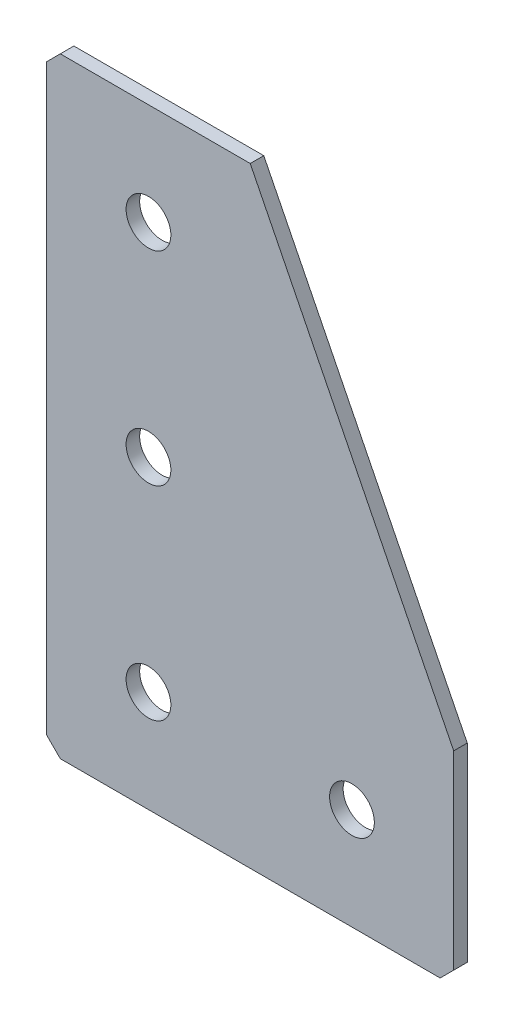
ISO-10303-21;
HEADER;
FILE_DESCRIPTION(('STEP AP214'),'2;1');
FILE_NAME('part.step','',(''),(''),'','','');
FILE_SCHEMA(('AUTOMOTIVE_DESIGN { 1 0 10303 214 1 1 1 1 }'));
ENDSEC;
DATA;
#1=APPLICATION_CONTEXT('core data for automotive mechanical design processes');
#2=APPLICATION_PROTOCOL_DEFINITION('international standard','automotive_design',2000,#1);
#3=PRODUCT_CONTEXT('',#1,'mechanical');
#4=PRODUCT('Part','Part','',(#3));
#5=PRODUCT_RELATED_PRODUCT_CATEGORY('part','',(#4));
#6=PRODUCT_DEFINITION_FORMATION('','',#4);
#7=PRODUCT_DEFINITION_CONTEXT('part definition',#1,'design');
#8=PRODUCT_DEFINITION('design','',#6,#7);
#9=PRODUCT_DEFINITION_SHAPE('','',#8);
#10=(LENGTH_UNIT() NAMED_UNIT(*) SI_UNIT(.MILLI.,.METRE.));
#11=(NAMED_UNIT(*) PLANE_ANGLE_UNIT() SI_UNIT($,.RADIAN.));
#12=(NAMED_UNIT(*) SI_UNIT($,.STERADIAN.) SOLID_ANGLE_UNIT());
#13=UNCERTAINTY_MEASURE_WITH_UNIT(LENGTH_MEASURE(1.E-05),#10,'distance_accuracy_value','');
#14=(GEOMETRIC_REPRESENTATION_CONTEXT(3) GLOBAL_UNCERTAINTY_ASSIGNED_CONTEXT((#13)) GLOBAL_UNIT_ASSIGNED_CONTEXT((#10,
#11,#12)) REPRESENTATION_CONTEXT('',''));
#15=CARTESIAN_POINT('',(0.,0.,0.));
#16=DIRECTION('',(0.,0.,1.));
#17=DIRECTION('',(1.,0.,0.));
#18=AXIS2_PLACEMENT_3D('',#15,#16,#17);
#19=CARTESIAN_POINT('',(30.,0.,-2.));
#20=DIRECTION('',(0.,-1.,0.));
#21=DIRECTION('',(1.,0.,0.));
#22=AXIS2_PLACEMENT_3D('',#19,#20,#21);
#23=PLANE('',#22);
#24=DIRECTION('',(1.,0.,0.));
#25=VECTOR('',#24,1.);
#26=CARTESIAN_POINT('',(30.,0.,-2.));
#27=LINE('',#26,#25);
#28=CARTESIAN_POINT('',(2.,0.,-2.));
#29=VERTEX_POINT('',#28);
#30=CARTESIAN_POINT('',(30.,0.,-2.));
#31=VERTEX_POINT('',#30);
#32=EDGE_CURVE('E106',#29,#31,#27,.T.);
#33=ORIENTED_EDGE('',*,*,#32,.F.);
#34=DIRECTION('',(0.,0.,1.));
#35=VECTOR('',#34,1.);
#36=CARTESIAN_POINT('',(2.,0.,-2.));
#37=LINE('',#36,#35);
#38=CARTESIAN_POINT('',(2.,0.,0.));
#39=VERTEX_POINT('',#38);
#40=EDGE_CURVE('E135',#29,#39,#37,.T.);
#41=ORIENTED_EDGE('',*,*,#40,.T.);
#42=DIRECTION('',(1.,0.,0.));
#43=VECTOR('',#42,1.);
#44=CARTESIAN_POINT('',(30.,0.,0.));
#45=LINE('',#44,#43);
#46=CARTESIAN_POINT('',(30.,0.,0.));
#47=VERTEX_POINT('',#46);
#48=EDGE_CURVE('E132',#39,#47,#45,.T.);
#49=ORIENTED_EDGE('',*,*,#48,.T.);
#50=DIRECTION('',(0.,0.,1.));
#51=VECTOR('',#50,1.);
#52=CARTESIAN_POINT('',(30.,0.,-2.));
#53=LINE('',#52,#51);
#54=EDGE_CURVE('E124',#31,#47,#53,.T.);
#55=ORIENTED_EDGE('',*,*,#54,.F.);
#56=EDGE_LOOP('',(#33,#41,#49,#55));
#57=FACE_BOUND('',#56,.T.);
#58=ADVANCED_FACE('F41',(#57),#23,.F.);
#59=CARTESIAN_POINT('',(60.,-60.,-2.));
#60=DIRECTION('',(-0.894427190999916,-0.447213595499958,0.));
#61=DIRECTION('',(0.447213595499958,-0.894427190999916,0.));
#62=AXIS2_PLACEMENT_3D('',#59,#60,#61);
#63=PLANE('',#62);
#64=DIRECTION('',(0.447213595499958,-0.894427190999916,0.));
#65=VECTOR('',#64,1.);
#66=CARTESIAN_POINT('',(60.,-60.,0.));
#67=LINE('',#66,#65);
#68=CARTESIAN_POINT('',(60.,-60.,0.));
#69=VERTEX_POINT('',#68);
#70=EDGE_CURVE('E190',#47,#69,#67,.T.);
#71=ORIENTED_EDGE('',*,*,#70,.T.);
#72=DIRECTION('',(0.,0.,1.));
#73=VECTOR('',#72,1.);
#74=CARTESIAN_POINT('',(60.,-60.,-2.));
#75=LINE('',#74,#73);
#76=CARTESIAN_POINT('',(60.,-60.,-2.));
#77=VERTEX_POINT('',#76);
#78=EDGE_CURVE('E126',#77,#69,#75,.T.);
#79=ORIENTED_EDGE('',*,*,#78,.F.);
#80=DIRECTION('',(0.447213595499958,-0.894427190999916,0.));
#81=VECTOR('',#80,1.);
#82=CARTESIAN_POINT('',(60.,-60.,-2.));
#83=LINE('',#82,#81);
#84=EDGE_CURVE('E110',#31,#77,#83,.T.);
#85=ORIENTED_EDGE('',*,*,#84,.F.);
#86=ORIENTED_EDGE('',*,*,#54,.T.);
#87=EDGE_LOOP('',(#71,#79,#85,#86));
#88=FACE_BOUND('',#87,.T.);
#89=ADVANCED_FACE('F123',(#88),#63,.F.);
#90=CARTESIAN_POINT('',(60.,-90.,-2.));
#91=DIRECTION('',(-1.,0.,0.));
#92=DIRECTION('',(0.,-1.,0.));
#93=AXIS2_PLACEMENT_3D('',#90,#91,#92);
#94=PLANE('',#93);
#95=DIRECTION('',(0.,-1.,0.));
#96=VECTOR('',#95,1.);
#97=CARTESIAN_POINT('',(60.,-90.,0.));
#98=LINE('',#97,#96);
#99=CARTESIAN_POINT('',(60.,-88.,0.));
#100=VERTEX_POINT('',#99);
#101=EDGE_CURVE('E184',#69,#100,#98,.T.);
#102=ORIENTED_EDGE('',*,*,#101,.T.);
#103=DIRECTION('',(0.,0.,-1.));
#104=VECTOR('',#103,1.);
#105=CARTESIAN_POINT('',(60.,-88.,-2.));
#106=LINE('',#105,#104);
#107=CARTESIAN_POINT('',(60.,-88.,-2.));
#108=VERTEX_POINT('',#107);
#109=EDGE_CURVE('E11',#100,#108,#106,.T.);
#110=ORIENTED_EDGE('',*,*,#109,.T.);
#111=DIRECTION('',(0.,-1.,0.));
#112=VECTOR('',#111,1.);
#113=CARTESIAN_POINT('',(60.,-90.,-2.));
#114=LINE('',#113,#112);
#115=EDGE_CURVE('E129',#77,#108,#114,.T.);
#116=ORIENTED_EDGE('',*,*,#115,.F.);
#117=ORIENTED_EDGE('',*,*,#78,.T.);
#118=EDGE_LOOP('',(#102,#110,#116,#117));
#119=FACE_BOUND('',#118,.T.);
#120=ADVANCED_FACE('F269',(#119),#94,.F.);
#121=CARTESIAN_POINT('',(0.,-90.,-2.));
#122=DIRECTION('',(0.,1.,0.));
#123=DIRECTION('',(0.,0.,1.));
#124=AXIS2_PLACEMENT_3D('',#121,#122,#123);
#125=PLANE('',#124);
#126=DIRECTION('',(-1.,0.,0.));
#127=VECTOR('',#126,1.);
#128=CARTESIAN_POINT('',(0.,-90.,-2.));
#129=LINE('',#128,#127);
#130=CARTESIAN_POINT('',(58.,-90.,-2.));
#131=VERTEX_POINT('',#130);
#132=CARTESIAN_POINT('',(2.00000000000002,-90.,-2.));
#133=VERTEX_POINT('',#132);
#134=EDGE_CURVE('E176',#131,#133,#129,.T.);
#135=ORIENTED_EDGE('',*,*,#134,.F.);
#136=DIRECTION('',(0.,0.,1.));
#137=VECTOR('',#136,1.);
#138=CARTESIAN_POINT('',(58.,-90.,-2.));
#139=LINE('',#138,#137);
#140=CARTESIAN_POINT('',(58.,-90.,0.));
#141=VERTEX_POINT('',#140);
#142=EDGE_CURVE('E50',#131,#141,#139,.T.);
#143=ORIENTED_EDGE('',*,*,#142,.T.);
#144=DIRECTION('',(-1.,0.,0.));
#145=VECTOR('',#144,1.);
#146=CARTESIAN_POINT('',(0.,-90.,0.));
#147=LINE('',#146,#145);
#148=CARTESIAN_POINT('',(2.00000000000002,-90.,0.));
#149=VERTEX_POINT('',#148);
#150=EDGE_CURVE('E175',#141,#149,#147,.T.);
#151=ORIENTED_EDGE('',*,*,#150,.T.);
#152=DIRECTION('',(0.,0.,-1.));
#153=VECTOR('',#152,1.);
#154=CARTESIAN_POINT('',(2.00000000000002,-90.,-2.));
#155=LINE('',#154,#153);
#156=EDGE_CURVE('E57',#149,#133,#155,.T.);
#157=ORIENTED_EDGE('',*,*,#156,.T.);
#158=EDGE_LOOP('',(#135,#143,#151,#157));
#159=FACE_BOUND('',#158,.T.);
#160=ADVANCED_FACE('F174',(#159),#125,.F.);
#161=CARTESIAN_POINT('',(0.,0.,-2.));
#162=DIRECTION('',(1.,0.,0.));
#163=DIRECTION('',(0.,0.,-1.));
#164=AXIS2_PLACEMENT_3D('',#161,#162,#163);
#165=PLANE('',#164);
#166=DIRECTION('',(0.,1.,0.));
#167=VECTOR('',#166,1.);
#168=CARTESIAN_POINT('',(0.,0.,0.));
#169=LINE('',#168,#167);
#170=CARTESIAN_POINT('',(0.,-88.,0.));
#171=VERTEX_POINT('',#170);
#172=CARTESIAN_POINT('',(0.,-2.00000000000001,0.));
#173=VERTEX_POINT('',#172);
#174=EDGE_CURVE('E119',#171,#173,#169,.T.);
#175=ORIENTED_EDGE('',*,*,#174,.T.);
#176=DIRECTION('',(0.,0.,-1.));
#177=VECTOR('',#176,1.);
#178=CARTESIAN_POINT('',(0.,-2.00000000000002,-2.));
#179=LINE('',#178,#177);
#180=CARTESIAN_POINT('',(0.,-2.00000000000001,-2.));
#181=VERTEX_POINT('',#180);
#182=EDGE_CURVE('E158',#173,#181,#179,.T.);
#183=ORIENTED_EDGE('',*,*,#182,.T.);
#184=DIRECTION('',(0.,1.,0.));
#185=VECTOR('',#184,1.);
#186=CARTESIAN_POINT('',(0.,0.,-2.));
#187=LINE('',#186,#185);
#188=CARTESIAN_POINT('',(0.,-88.,-2.));
#189=VERTEX_POINT('',#188);
#190=EDGE_CURVE('E142',#189,#181,#187,.T.);
#191=ORIENTED_EDGE('',*,*,#190,.F.);
#192=DIRECTION('',(0.,0.,1.));
#193=VECTOR('',#192,1.);
#194=CARTESIAN_POINT('',(0.,-88.,-2.));
#195=LINE('',#194,#193);
#196=EDGE_CURVE('E154',#189,#171,#195,.T.);
#197=ORIENTED_EDGE('',*,*,#196,.T.);
#198=EDGE_LOOP('',(#175,#183,#191,#197));
#199=FACE_BOUND('',#198,.T.);
#200=ADVANCED_FACE('F241',(#199),#165,.F.);
#201=CARTESIAN_POINT('',(0.,0.,-2.));
#202=DIRECTION('',(0.,0.,1.));
#203=DIRECTION('',(1.,0.,0.));
#204=AXIS2_PLACEMENT_3D('',#201,#202,#203);
#205=PLANE('',#204);
#206=CARTESIAN_POINT('',(45.,-75.,-2.));
#207=DIRECTION('',(0.,0.,-1.));
#208=DIRECTION('',(0.,1.,0.));
#209=AXIS2_PLACEMENT_3D('',#206,#207,#208);
#210=CIRCLE('',#209,3.3);
#211=CARTESIAN_POINT('',(45.,-71.7,-2.));
#212=VERTEX_POINT('',#211);
#213=EDGE_CURVE('E231',#212,#212,#210,.T.);
#214=ORIENTED_EDGE('',*,*,#213,.F.);
#215=EDGE_LOOP('',(#214));
#216=FACE_BOUND('',#215,.T.);
#217=CARTESIAN_POINT('',(15.,-75.,-2.));
#218=DIRECTION('',(0.,0.,-1.));
#219=DIRECTION('',(0.,1.,0.));
#220=AXIS2_PLACEMENT_3D('',#217,#218,#219);
#221=CIRCLE('',#220,3.3);
#222=CARTESIAN_POINT('',(15.,-71.7,-2.));
#223=VERTEX_POINT('',#222);
#224=EDGE_CURVE('E223',#223,#223,#221,.T.);
#225=ORIENTED_EDGE('',*,*,#224,.F.);
#226=EDGE_LOOP('',(#225));
#227=FACE_BOUND('',#226,.T.);
#228=CARTESIAN_POINT('',(15.,-45.,-2.));
#229=DIRECTION('',(0.,0.,-1.));
#230=DIRECTION('',(0.,1.,0.));
#231=AXIS2_PLACEMENT_3D('',#228,#229,#230);
#232=CIRCLE('',#231,3.3);
#233=CARTESIAN_POINT('',(15.,-41.7,-2.));
#234=VERTEX_POINT('',#233);
#235=EDGE_CURVE('E215',#234,#234,#232,.T.);
#236=ORIENTED_EDGE('',*,*,#235,.F.);
#237=EDGE_LOOP('',(#236));
#238=FACE_BOUND('',#237,.T.);
#239=CARTESIAN_POINT('',(15.,-15.,-2.));
#240=DIRECTION('',(0.,0.,-1.));
#241=DIRECTION('',(0.,1.,0.));
#242=AXIS2_PLACEMENT_3D('',#239,#240,#241);
#243=CIRCLE('',#242,3.3);
#244=CARTESIAN_POINT('',(15.,-11.7,-2.));
#245=VERTEX_POINT('',#244);
#246=EDGE_CURVE('E207',#245,#245,#243,.T.);
#247=ORIENTED_EDGE('',*,*,#246,.F.);
#248=EDGE_LOOP('',(#247));
#249=FACE_BOUND('',#248,.T.);
#250=ORIENTED_EDGE('',*,*,#190,.T.);
#251=DIRECTION('',(-0.707106781186545,-0.70710678118655,0.));
#252=VECTOR('',#251,1.);
#253=CARTESIAN_POINT('',(2.,0.,-2.));
#254=LINE('',#253,#252);
#255=EDGE_CURVE('E113',#181,#29,#254,.F.);
#256=ORIENTED_EDGE('',*,*,#255,.T.);
#257=ORIENTED_EDGE('',*,*,#32,.T.);
#258=ORIENTED_EDGE('',*,*,#84,.T.);
#259=ORIENTED_EDGE('',*,*,#115,.T.);
#260=DIRECTION('',(0.707106781186545,0.70710678118655,0.));
#261=VECTOR('',#260,1.);
#262=CARTESIAN_POINT('',(58.,-90.,-2.));
#263=LINE('',#262,#261);
#264=EDGE_CURVE('E64',#108,#131,#263,.F.);
#265=ORIENTED_EDGE('',*,*,#264,.T.);
#266=ORIENTED_EDGE('',*,*,#134,.T.);
#267=DIRECTION('',(0.707106781186552,-0.707106781186543,0.));
#268=VECTOR('',#267,1.);
#269=CARTESIAN_POINT('',(0.,-88.,-2.));
#270=LINE('',#269,#268);
#271=EDGE_CURVE('E161',#133,#189,#270,.F.);
#272=ORIENTED_EDGE('',*,*,#271,.T.);
#273=EDGE_LOOP('',(#250,#256,#257,#258,#259,#265,#266,#272));
#274=FACE_BOUND('',#273,.T.);
#275=ADVANCED_FACE('F109',(#216,#227,#238,#249,#274),#205,.F.);
#276=CARTESIAN_POINT('',(0.,0.,0.));
#277=DIRECTION('',(0.,0.,1.));
#278=DIRECTION('',(1.,0.,0.));
#279=AXIS2_PLACEMENT_3D('',#276,#277,#278);
#280=PLANE('',#279);
#281=CARTESIAN_POINT('',(45.,-75.,0.));
#282=DIRECTION('',(0.,0.,-1.));
#283=DIRECTION('',(0.,1.,0.));
#284=AXIS2_PLACEMENT_3D('',#281,#282,#283);
#285=CIRCLE('',#284,3.3);
#286=CARTESIAN_POINT('',(45.,-71.7,0.));
#287=VERTEX_POINT('',#286);
#288=EDGE_CURVE('E227',#287,#287,#285,.T.);
#289=ORIENTED_EDGE('',*,*,#288,.T.);
#290=EDGE_LOOP('',(#289));
#291=FACE_BOUND('',#290,.T.);
#292=CARTESIAN_POINT('',(15.,-75.,0.));
#293=DIRECTION('',(0.,0.,-1.));
#294=DIRECTION('',(0.,1.,0.));
#295=AXIS2_PLACEMENT_3D('',#292,#293,#294);
#296=CIRCLE('',#295,3.3);
#297=CARTESIAN_POINT('',(15.,-71.7,0.));
#298=VERTEX_POINT('',#297);
#299=EDGE_CURVE('E219',#298,#298,#296,.T.);
#300=ORIENTED_EDGE('',*,*,#299,.T.);
#301=EDGE_LOOP('',(#300));
#302=FACE_BOUND('',#301,.T.);
#303=CARTESIAN_POINT('',(15.,-45.,0.));
#304=DIRECTION('',(0.,0.,-1.));
#305=DIRECTION('',(0.,1.,0.));
#306=AXIS2_PLACEMENT_3D('',#303,#304,#305);
#307=CIRCLE('',#306,3.3);
#308=CARTESIAN_POINT('',(15.,-41.7,0.));
#309=VERTEX_POINT('',#308);
#310=EDGE_CURVE('E211',#309,#309,#307,.T.);
#311=ORIENTED_EDGE('',*,*,#310,.T.);
#312=EDGE_LOOP('',(#311));
#313=FACE_BOUND('',#312,.T.);
#314=CARTESIAN_POINT('',(15.,-15.,0.));
#315=DIRECTION('',(0.,0.,-1.));
#316=DIRECTION('',(0.,1.,0.));
#317=AXIS2_PLACEMENT_3D('',#314,#315,#316);
#318=CIRCLE('',#317,3.3);
#319=CARTESIAN_POINT('',(15.,-11.7,0.));
#320=VERTEX_POINT('',#319);
#321=EDGE_CURVE('E197',#320,#320,#318,.T.);
#322=ORIENTED_EDGE('',*,*,#321,.T.);
#323=EDGE_LOOP('',(#322));
#324=FACE_BOUND('',#323,.T.);
#325=ORIENTED_EDGE('',*,*,#48,.F.);
#326=DIRECTION('',(0.707106781186545,0.70710678118655,0.));
#327=VECTOR('',#326,1.);
#328=CARTESIAN_POINT('',(1.00000000000001,-1.,0.));
#329=LINE('',#328,#327);
#330=EDGE_CURVE('E151',#39,#173,#329,.F.);
#331=ORIENTED_EDGE('',*,*,#330,.T.);
#332=ORIENTED_EDGE('',*,*,#174,.F.);
#333=DIRECTION('',(-0.707106781186552,0.707106781186543,0.));
#334=VECTOR('',#333,1.);
#335=CARTESIAN_POINT('',(-44.,-44.0000000000006,0.));
#336=LINE('',#335,#334);
#337=EDGE_CURVE('E140',#171,#149,#336,.F.);
#338=ORIENTED_EDGE('',*,*,#337,.T.);
#339=ORIENTED_EDGE('',*,*,#150,.F.);
#340=DIRECTION('',(-0.707106781186545,-0.70710678118655,0.));
#341=VECTOR('',#340,1.);
#342=CARTESIAN_POINT('',(74.0000000000002,-73.9999999999997,0.));
#343=LINE('',#342,#341);
#344=EDGE_CURVE('E148',#141,#100,#343,.F.);
#345=ORIENTED_EDGE('',*,*,#344,.T.);
#346=ORIENTED_EDGE('',*,*,#101,.F.);
#347=ORIENTED_EDGE('',*,*,#70,.F.);
#348=EDGE_LOOP('',(#325,#331,#332,#338,#339,#345,#346,#347));
#349=FACE_BOUND('',#348,.T.);
#350=ADVANCED_FACE('F179',(#291,#302,#313,#324,#349),#280,.T.);
#351=CARTESIAN_POINT('',(15.,-15.,-2.));
#352=DIRECTION('',(0.,0.,-1.));
#353=DIRECTION('',(0.,1.,0.));
#354=AXIS2_PLACEMENT_3D('',#351,#352,#353);
#355=CYLINDRICAL_SURFACE('',#354,3.3);
#356=ORIENTED_EDGE('',*,*,#321,.F.);
#357=EDGE_LOOP('',(#356));
#358=FACE_BOUND('',#357,.T.);
#359=ORIENTED_EDGE('',*,*,#246,.T.);
#360=EDGE_LOOP('',(#359));
#361=FACE_BOUND('',#360,.T.);
#362=ADVANCED_FACE('F249',(#358,#361),#355,.F.);
#363=CARTESIAN_POINT('',(15.,-45.,-2.));
#364=DIRECTION('',(0.,0.,-1.));
#365=DIRECTION('',(0.,1.,0.));
#366=AXIS2_PLACEMENT_3D('',#363,#364,#365);
#367=CYLINDRICAL_SURFACE('',#366,3.3);
#368=ORIENTED_EDGE('',*,*,#310,.F.);
#369=EDGE_LOOP('',(#368));
#370=FACE_BOUND('',#369,.T.);
#371=ORIENTED_EDGE('',*,*,#235,.T.);
#372=EDGE_LOOP('',(#371));
#373=FACE_BOUND('',#372,.T.);
#374=ADVANCED_FACE('F251',(#370,#373),#367,.F.);
#375=CARTESIAN_POINT('',(15.,-75.,-2.));
#376=DIRECTION('',(0.,0.,-1.));
#377=DIRECTION('',(0.,1.,0.));
#378=AXIS2_PLACEMENT_3D('',#375,#376,#377);
#379=CYLINDRICAL_SURFACE('',#378,3.3);
#380=ORIENTED_EDGE('',*,*,#299,.F.);
#381=EDGE_LOOP('',(#380));
#382=FACE_BOUND('',#381,.T.);
#383=ORIENTED_EDGE('',*,*,#224,.T.);
#384=EDGE_LOOP('',(#383));
#385=FACE_BOUND('',#384,.T.);
#386=ADVANCED_FACE('F258',(#382,#385),#379,.F.);
#387=CARTESIAN_POINT('',(45.,-75.,-2.));
#388=DIRECTION('',(0.,0.,-1.));
#389=DIRECTION('',(0.,1.,0.));
#390=AXIS2_PLACEMENT_3D('',#387,#388,#389);
#391=CYLINDRICAL_SURFACE('',#390,3.3);
#392=ORIENTED_EDGE('',*,*,#288,.F.);
#393=EDGE_LOOP('',(#392));
#394=FACE_BOUND('',#393,.T.);
#395=ORIENTED_EDGE('',*,*,#213,.T.);
#396=EDGE_LOOP('',(#395));
#397=FACE_BOUND('',#396,.T.);
#398=ADVANCED_FACE('F237',(#394,#397),#391,.F.);
#399=CARTESIAN_POINT('',(2.,0.,-2.));
#400=DIRECTION('',(0.70710678118655,-0.707106781186545,0.));
#401=DIRECTION('',(0.,0.,1.));
#402=AXIS2_PLACEMENT_3D('',#399,#400,#401);
#403=PLANE('',#402);
#404=ORIENTED_EDGE('',*,*,#255,.F.);
#405=ORIENTED_EDGE('',*,*,#182,.F.);
#406=ORIENTED_EDGE('',*,*,#330,.F.);
#407=ORIENTED_EDGE('',*,*,#40,.F.);
#408=EDGE_LOOP('',(#404,#405,#406,#407));
#409=FACE_BOUND('',#408,.T.);
#410=ADVANCED_FACE('F273',(#409),#403,.F.);
#411=CARTESIAN_POINT('',(58.,-90.,-2.));
#412=DIRECTION('',(-0.70710678118655,0.707106781186545,0.));
#413=DIRECTION('',(0.,0.,1.));
#414=AXIS2_PLACEMENT_3D('',#411,#412,#413);
#415=PLANE('',#414);
#416=ORIENTED_EDGE('',*,*,#264,.F.);
#417=ORIENTED_EDGE('',*,*,#109,.F.);
#418=ORIENTED_EDGE('',*,*,#344,.F.);
#419=ORIENTED_EDGE('',*,*,#142,.F.);
#420=EDGE_LOOP('',(#416,#417,#418,#419));
#421=FACE_BOUND('',#420,.T.);
#422=ADVANCED_FACE('F275',(#421),#415,.F.);
#423=CARTESIAN_POINT('',(0.,-88.,-2.));
#424=DIRECTION('',(0.707106781186543,0.707106781186552,0.));
#425=DIRECTION('',(0.,0.,1.));
#426=AXIS2_PLACEMENT_3D('',#423,#424,#425);
#427=PLANE('',#426);
#428=ORIENTED_EDGE('',*,*,#271,.F.);
#429=ORIENTED_EDGE('',*,*,#156,.F.);
#430=ORIENTED_EDGE('',*,*,#337,.F.);
#431=ORIENTED_EDGE('',*,*,#196,.F.);
#432=EDGE_LOOP('',(#428,#429,#430,#431));
#433=FACE_BOUND('',#432,.T.);
#434=ADVANCED_FACE('F43',(#433),#427,.F.);
#435=CLOSED_SHELL('',(#58,#89,#120,#160,#200,#275,#350,#362,#374,#386,#398,#410,#422,#434));
#436=MANIFOLD_SOLID_BREP('B2',#435);
#437=ADVANCED_BREP_SHAPE_REPRESENTATION('',(#18,#436),#14);
#438=SHAPE_DEFINITION_REPRESENTATION(#9,#437);
ENDSEC;
END-ISO-10303-21;
